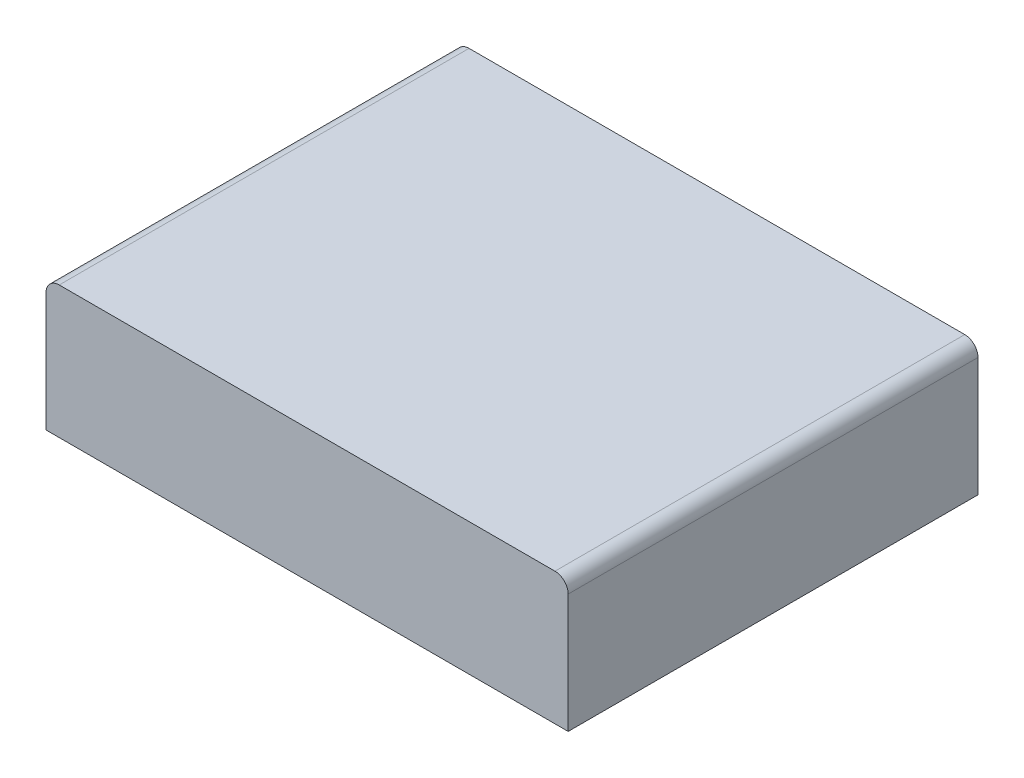
ISO-10303-21;
HEADER;
FILE_DESCRIPTION(('STEP AP214'),'2;1');
FILE_NAME('part.step','',(''),(''),'','','');
FILE_SCHEMA(('AUTOMOTIVE_DESIGN { 1 0 10303 214 1 1 1 1 }'));
ENDSEC;
DATA;
#1=APPLICATION_CONTEXT('core data for automotive mechanical design processes');
#2=APPLICATION_PROTOCOL_DEFINITION('international standard','automotive_design',2000,#1);
#3=PRODUCT_CONTEXT('',#1,'mechanical');
#4=PRODUCT('Part','Part','',(#3));
#5=PRODUCT_RELATED_PRODUCT_CATEGORY('part','',(#4));
#6=PRODUCT_DEFINITION_FORMATION('','',#4);
#7=PRODUCT_DEFINITION_CONTEXT('part definition',#1,'design');
#8=PRODUCT_DEFINITION('design','',#6,#7);
#9=PRODUCT_DEFINITION_SHAPE('','',#8);
#10=(LENGTH_UNIT() NAMED_UNIT(*) SI_UNIT(.MILLI.,.METRE.));
#11=(NAMED_UNIT(*) PLANE_ANGLE_UNIT() SI_UNIT($,.RADIAN.));
#12=(NAMED_UNIT(*) SI_UNIT($,.STERADIAN.) SOLID_ANGLE_UNIT());
#13=UNCERTAINTY_MEASURE_WITH_UNIT(LENGTH_MEASURE(1.E-05),#10,'distance_accuracy_value','');
#14=(GEOMETRIC_REPRESENTATION_CONTEXT(3) GLOBAL_UNCERTAINTY_ASSIGNED_CONTEXT((#13)) GLOBAL_UNIT_ASSIGNED_CONTEXT((#10,
#11,#12)) REPRESENTATION_CONTEXT('',''));
#15=CARTESIAN_POINT('',(0.,0.,0.));
#16=DIRECTION('',(0.,0.,1.));
#17=DIRECTION('',(1.,0.,0.));
#18=AXIS2_PLACEMENT_3D('',#15,#16,#17);
#19=CARTESIAN_POINT('',(-12.3032623511406,39.1976983767566,241.580273248527));
#20=DIRECTION('',(0.,0.,1.));
#21=DIRECTION('',(1.,0.,0.));
#22=AXIS2_PLACEMENT_3D('',#19,#20,#21);
#23=CYLINDRICAL_SURFACE('',#22,0.0508);
#24=CARTESIAN_POINT('',(-12.3032623511406,39.1976983767566,240.792873248526));
#25=DIRECTION('',(0.,0.,1.));
#26=DIRECTION('',(1.,0.,0.));
#27=AXIS2_PLACEMENT_3D('',#24,#25,#26);
#28=CIRCLE('',#27,0.0508);
#29=CARTESIAN_POINT('',(-12.3032623511406,39.2484983767566,240.792873248526));
#30=VERTEX_POINT('',#29);
#31=CARTESIAN_POINT('',(-12.3540623511407,39.1976983767566,240.792873248526));
#32=VERTEX_POINT('',#31);
#33=EDGE_CURVE('E125',#30,#32,#28,.T.);
#34=ORIENTED_EDGE('',*,*,#33,.T.);
#35=DIRECTION('',(0.,0.,-1.));
#36=VECTOR('',#35,1.);
#37=CARTESIAN_POINT('',(-12.3540623511407,39.1976983767566,242.367673248527));
#38=LINE('',#37,#36);
#39=CARTESIAN_POINT('',(-12.3540623511407,39.1976983767566,242.367673248527));
#40=VERTEX_POINT('',#39);
#41=EDGE_CURVE('E108',#32,#40,#38,.F.);
#42=ORIENTED_EDGE('',*,*,#41,.T.);
#43=CARTESIAN_POINT('',(-12.3032623511406,39.1976983767566,242.367673248527));
#44=DIRECTION('',(0.,0.,1.));
#45=DIRECTION('',(1.,0.,0.));
#46=AXIS2_PLACEMENT_3D('',#43,#44,#45);
#47=CIRCLE('',#46,0.0508);
#48=CARTESIAN_POINT('',(-12.3032623511406,39.2484983767566,242.367673248527));
#49=VERTEX_POINT('',#48);
#50=EDGE_CURVE('E20',#40,#49,#47,.F.);
#51=ORIENTED_EDGE('',*,*,#50,.T.);
#52=DIRECTION('',(0.,0.,-1.));
#53=VECTOR('',#52,1.);
#54=CARTESIAN_POINT('',(-12.3032623511406,39.2484983767566,241.580273248527));
#55=LINE('',#54,#53);
#56=EDGE_CURVE('E104',#49,#30,#55,.T.);
#57=ORIENTED_EDGE('',*,*,#56,.T.);
#58=EDGE_LOOP('',(#34,#42,#51,#57));
#59=FACE_BOUND('',#58,.T.);
#60=ADVANCED_FACE('F17',(#59),#23,.T.);
#61=CARTESIAN_POINT('',(-10.3982623511407,39.1976983767566,241.580273248527));
#62=DIRECTION('',(0.,0.,-1.));
#63=DIRECTION('',(-1.,0.,0.));
#64=AXIS2_PLACEMENT_3D('',#61,#62,#63);
#65=CYLINDRICAL_SURFACE('',#64,0.0508);
#66=CARTESIAN_POINT('',(-10.3982623511407,39.1976983767566,242.367673248527));
#67=DIRECTION('',(0.,0.,-1.));
#68=DIRECTION('',(-1.,0.,0.));
#69=AXIS2_PLACEMENT_3D('',#66,#67,#68);
#70=CIRCLE('',#69,0.0508);
#71=CARTESIAN_POINT('',(-10.3982623511407,39.2484983767566,242.367673248527));
#72=VERTEX_POINT('',#71);
#73=CARTESIAN_POINT('',(-10.3474623511407,39.1976983767566,242.367673248527));
#74=VERTEX_POINT('',#73);
#75=EDGE_CURVE('E113',#72,#74,#70,.T.);
#76=ORIENTED_EDGE('',*,*,#75,.T.);
#77=DIRECTION('',(0.,0.,1.));
#78=VECTOR('',#77,1.);
#79=CARTESIAN_POINT('',(-10.3474623511407,39.1976983767566,242.367673248527));
#80=LINE('',#79,#78);
#81=CARTESIAN_POINT('',(-10.3474623511407,39.1976983767566,240.792873248526));
#82=VERTEX_POINT('',#81);
#83=EDGE_CURVE('E100',#74,#82,#80,.F.);
#84=ORIENTED_EDGE('',*,*,#83,.T.);
#85=CARTESIAN_POINT('',(-10.3982623511407,39.1976983767566,240.792873248526));
#86=DIRECTION('',(0.,0.,-1.));
#87=DIRECTION('',(-1.,0.,0.));
#88=AXIS2_PLACEMENT_3D('',#85,#86,#87);
#89=CIRCLE('',#88,0.0508);
#90=CARTESIAN_POINT('',(-10.3982623511407,39.2484983767566,240.792873248526));
#91=VERTEX_POINT('',#90);
#92=EDGE_CURVE('E122',#82,#91,#89,.F.);
#93=ORIENTED_EDGE('',*,*,#92,.T.);
#94=DIRECTION('',(0.,0.,-1.));
#95=VECTOR('',#94,1.);
#96=CARTESIAN_POINT('',(-10.3982623511407,39.2484983767566,241.580273248527));
#97=LINE('',#96,#95);
#98=EDGE_CURVE('E109',#91,#72,#97,.F.);
#99=ORIENTED_EDGE('',*,*,#98,.T.);
#100=EDGE_LOOP('',(#76,#84,#93,#99));
#101=FACE_BOUND('',#100,.T.);
#102=ADVANCED_FACE('F161',(#101),#65,.T.);
#103=CARTESIAN_POINT('',(-11.3507623511407,39.2484983767566,241.580273248527));
#104=DIRECTION('',(0.,-1.,0.));
#105=DIRECTION('',(0.,0.,-1.));
#106=AXIS2_PLACEMENT_3D('',#103,#104,#105);
#107=PLANE('',#106);
#108=DIRECTION('',(-1.,0.,0.));
#109=VECTOR('',#108,1.);
#110=CARTESIAN_POINT('',(-12.3540623511407,39.2484983767566,242.367673248527));
#111=LINE('',#110,#109);
#112=EDGE_CURVE('E137',#49,#72,#111,.F.);
#113=ORIENTED_EDGE('',*,*,#112,.T.);
#114=ORIENTED_EDGE('',*,*,#98,.F.);
#115=DIRECTION('',(1.,0.,0.));
#116=VECTOR('',#115,1.);
#117=CARTESIAN_POINT('',(-12.3540623511407,39.2484983767566,240.792873248526));
#118=LINE('',#117,#116);
#119=EDGE_CURVE('E117',#91,#30,#118,.F.);
#120=ORIENTED_EDGE('',*,*,#119,.T.);
#121=ORIENTED_EDGE('',*,*,#56,.F.);
#122=EDGE_LOOP('',(#113,#114,#120,#121));
#123=FACE_BOUND('',#122,.T.);
#124=ADVANCED_FACE('F135',(#123),#107,.F.);
#125=CARTESIAN_POINT('',(-12.3540623511407,39.2484983767566,242.367673248527));
#126=DIRECTION('',(1.,0.,0.));
#127=DIRECTION('',(0.,0.,-1.));
#128=AXIS2_PLACEMENT_3D('',#125,#126,#127);
#129=PLANE('',#128);
#130=DIRECTION('',(0.,1.,0.));
#131=VECTOR('',#130,1.);
#132=CARTESIAN_POINT('',(-12.3540623511407,39.2484983767566,240.792873248526));
#133=LINE('',#132,#131);
#134=CARTESIAN_POINT('',(-12.3540623511407,38.7404983767566,240.792873248526));
#135=VERTEX_POINT('',#134);
#136=EDGE_CURVE('E79',#32,#135,#133,.F.);
#137=ORIENTED_EDGE('',*,*,#136,.T.);
#138=DIRECTION('',(0.,0.,-1.));
#139=VECTOR('',#138,1.);
#140=CARTESIAN_POINT('',(-12.3540623511407,38.7404983767566,241.580273248527));
#141=LINE('',#140,#139);
#142=CARTESIAN_POINT('',(-12.3540623511407,38.7404983767566,242.367673248527));
#143=VERTEX_POINT('',#142);
#144=EDGE_CURVE('E74',#143,#135,#141,.T.);
#145=ORIENTED_EDGE('',*,*,#144,.F.);
#146=DIRECTION('',(0.,1.,0.));
#147=VECTOR('',#146,1.);
#148=CARTESIAN_POINT('',(-12.3540623511407,39.2484983767566,242.367673248527));
#149=LINE('',#148,#147);
#150=EDGE_CURVE('E77',#143,#40,#149,.T.);
#151=ORIENTED_EDGE('',*,*,#150,.T.);
#152=ORIENTED_EDGE('',*,*,#41,.F.);
#153=EDGE_LOOP('',(#137,#145,#151,#152));
#154=FACE_BOUND('',#153,.T.);
#155=ADVANCED_FACE('F75',(#154),#129,.F.);
#156=CARTESIAN_POINT('',(-12.3540623511407,39.2484983767566,240.792873248526));
#157=DIRECTION('',(0.,0.,1.));
#158=DIRECTION('',(1.,0.,0.));
#159=AXIS2_PLACEMENT_3D('',#156,#157,#158);
#160=PLANE('',#159);
#161=ORIENTED_EDGE('',*,*,#119,.F.);
#162=ORIENTED_EDGE('',*,*,#92,.F.);
#163=DIRECTION('',(0.,1.,0.));
#164=VECTOR('',#163,1.);
#165=CARTESIAN_POINT('',(-10.3474623511407,39.2484983767566,240.792873248526));
#166=LINE('',#165,#164);
#167=CARTESIAN_POINT('',(-10.3474623511407,38.7404983767566,240.792873248526));
#168=VERTEX_POINT('',#167);
#169=EDGE_CURVE('E114',#82,#168,#166,.F.);
#170=ORIENTED_EDGE('',*,*,#169,.T.);
#171=DIRECTION('',(1.,0.,0.));
#172=VECTOR('',#171,1.);
#173=CARTESIAN_POINT('',(-11.3507623511407,38.7404983767566,240.792873248526));
#174=LINE('',#173,#172);
#175=EDGE_CURVE('E84',#135,#168,#174,.T.);
#176=ORIENTED_EDGE('',*,*,#175,.F.);
#177=ORIENTED_EDGE('',*,*,#136,.F.);
#178=ORIENTED_EDGE('',*,*,#33,.F.);
#179=EDGE_LOOP('',(#161,#162,#170,#176,#177,#178));
#180=FACE_BOUND('',#179,.T.);
#181=ADVANCED_FACE('F164',(#180),#160,.F.);
#182=CARTESIAN_POINT('',(-10.3474623511407,39.2484983767566,242.367673248527));
#183=DIRECTION('',(-1.,0.,0.));
#184=DIRECTION('',(0.,0.,1.));
#185=AXIS2_PLACEMENT_3D('',#182,#183,#184);
#186=PLANE('',#185);
#187=DIRECTION('',(0.,1.,0.));
#188=VECTOR('',#187,1.);
#189=CARTESIAN_POINT('',(-10.3474623511407,39.2484983767566,242.367673248527));
#190=LINE('',#189,#188);
#191=CARTESIAN_POINT('',(-10.3474623511407,38.7404983767566,242.367673248527));
#192=VERTEX_POINT('',#191);
#193=EDGE_CURVE('E36',#74,#192,#190,.F.);
#194=ORIENTED_EDGE('',*,*,#193,.T.);
#195=DIRECTION('',(0.,0.,-1.));
#196=VECTOR('',#195,1.);
#197=CARTESIAN_POINT('',(-10.3474623511407,38.7404983767566,241.580273248527));
#198=LINE('',#197,#196);
#199=EDGE_CURVE('E27',#168,#192,#198,.F.);
#200=ORIENTED_EDGE('',*,*,#199,.F.);
#201=ORIENTED_EDGE('',*,*,#169,.F.);
#202=ORIENTED_EDGE('',*,*,#83,.F.);
#203=EDGE_LOOP('',(#194,#200,#201,#202));
#204=FACE_BOUND('',#203,.T.);
#205=ADVANCED_FACE('F162',(#204),#186,.F.);
#206=CARTESIAN_POINT('',(-12.3540623511407,39.2484983767566,242.367673248527));
#207=DIRECTION('',(0.,0.,-1.));
#208=DIRECTION('',(-1.,0.,0.));
#209=AXIS2_PLACEMENT_3D('',#206,#207,#208);
#210=PLANE('',#209);
#211=ORIENTED_EDGE('',*,*,#150,.F.);
#212=DIRECTION('',(1.,0.,0.));
#213=VECTOR('',#212,1.);
#214=CARTESIAN_POINT('',(-11.3507623511407,38.7404983767566,242.367673248527));
#215=LINE('',#214,#213);
#216=EDGE_CURVE('E11',#192,#143,#215,.F.);
#217=ORIENTED_EDGE('',*,*,#216,.F.);
#218=ORIENTED_EDGE('',*,*,#193,.F.);
#219=ORIENTED_EDGE('',*,*,#75,.F.);
#220=ORIENTED_EDGE('',*,*,#112,.F.);
#221=ORIENTED_EDGE('',*,*,#50,.F.);
#222=EDGE_LOOP('',(#211,#217,#218,#219,#220,#221));
#223=FACE_BOUND('',#222,.T.);
#224=ADVANCED_FACE('F86',(#223),#210,.F.);
#225=CARTESIAN_POINT('',(-11.3507623511407,38.7404983767566,241.580273248527));
#226=DIRECTION('',(0.,-1.,0.));
#227=DIRECTION('',(0.,0.,-1.));
#228=AXIS2_PLACEMENT_3D('',#225,#226,#227);
#229=PLANE('',#228);
#230=ORIENTED_EDGE('',*,*,#199,.T.);
#231=ORIENTED_EDGE('',*,*,#216,.T.);
#232=ORIENTED_EDGE('',*,*,#144,.T.);
#233=ORIENTED_EDGE('',*,*,#175,.T.);
#234=EDGE_LOOP('',(#230,#231,#232,#233));
#235=FACE_BOUND('',#234,.T.);
#236=ADVANCED_FACE('F90',(#235),#229,.T.);
#237=CLOSED_SHELL('',(#60,#102,#124,#155,#181,#205,#224,#236));
#238=MANIFOLD_SOLID_BREP('B1',#237);
#239=ADVANCED_BREP_SHAPE_REPRESENTATION('',(#18,#238),#14);
#240=SHAPE_DEFINITION_REPRESENTATION(#9,#239);
ENDSEC;
END-ISO-10303-21;
